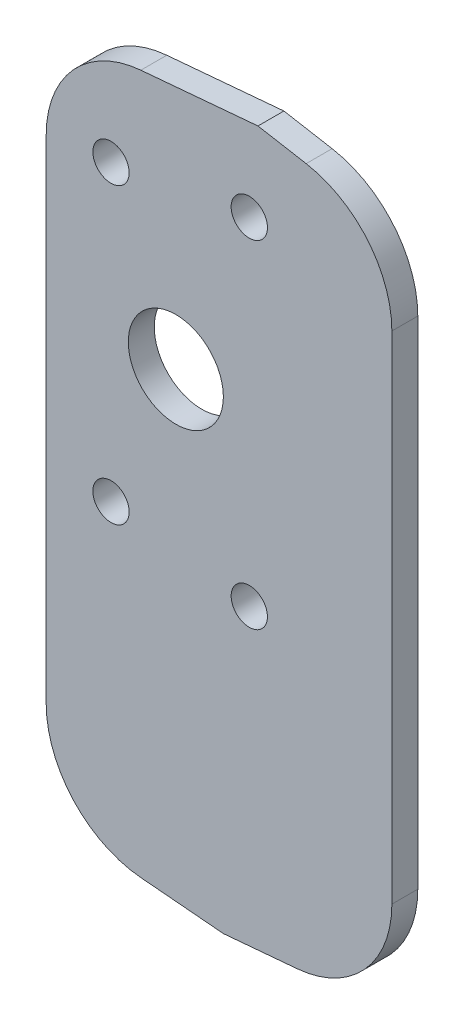
ISO-10303-21;
HEADER;
FILE_DESCRIPTION(('STEP AP214'),'2;1');
FILE_NAME('part.step','',(''),(''),'','','');
FILE_SCHEMA(('AUTOMOTIVE_DESIGN { 1 0 10303 214 1 1 1 1 }'));
ENDSEC;
DATA;
#1=APPLICATION_CONTEXT('core data for automotive mechanical design processes');
#2=APPLICATION_PROTOCOL_DEFINITION('international standard','automotive_design',2000,#1);
#3=PRODUCT_CONTEXT('',#1,'mechanical');
#4=PRODUCT('Part','Part','',(#3));
#5=PRODUCT_RELATED_PRODUCT_CATEGORY('part','',(#4));
#6=PRODUCT_DEFINITION_FORMATION('','',#4);
#7=PRODUCT_DEFINITION_CONTEXT('part definition',#1,'design');
#8=PRODUCT_DEFINITION('design','',#6,#7);
#9=PRODUCT_DEFINITION_SHAPE('','',#8);
#10=(LENGTH_UNIT() NAMED_UNIT(*) SI_UNIT(.MILLI.,.METRE.));
#11=(NAMED_UNIT(*) PLANE_ANGLE_UNIT() SI_UNIT($,.RADIAN.));
#12=(NAMED_UNIT(*) SI_UNIT($,.STERADIAN.) SOLID_ANGLE_UNIT());
#13=UNCERTAINTY_MEASURE_WITH_UNIT(LENGTH_MEASURE(1.E-05),#10,'distance_accuracy_value','');
#14=(GEOMETRIC_REPRESENTATION_CONTEXT(3) GLOBAL_UNCERTAINTY_ASSIGNED_CONTEXT((#13)) GLOBAL_UNIT_ASSIGNED_CONTEXT((#10,
#11,#12)) REPRESENTATION_CONTEXT('',''));
#15=CARTESIAN_POINT('',(0.,0.,0.));
#16=DIRECTION('',(0.,0.,1.));
#17=DIRECTION('',(1.,0.,0.));
#18=AXIS2_PLACEMENT_3D('',#15,#16,#17);
#19=CARTESIAN_POINT('',(-5.95987876232495,-14.4724405128534,3.));
#20=DIRECTION('',(1.,0.,0.));
#21=DIRECTION('',(0.,1.,0.));
#22=AXIS2_PLACEMENT_3D('',#19,#20,#21);
#23=PLANE('',#22);
#24=DIRECTION('',(0.,-1.,0.));
#25=VECTOR('',#24,1.);
#26=CARTESIAN_POINT('',(-5.95987876232495,-14.4724405128534,0.));
#27=LINE('',#26,#25);
#28=CARTESIAN_POINT('',(-5.959878762325,53.5315853989375,0.));
#29=VERTEX_POINT('',#28);
#30=CARTESIAN_POINT('',(-5.95987876232496,-3.47646642464427,0.));
#31=VERTEX_POINT('',#30);
#32=EDGE_CURVE('E124',#29,#31,#27,.T.);
#33=ORIENTED_EDGE('',*,*,#32,.T.);
#34=DIRECTION('',(0.,0.,-1.));
#35=VECTOR('',#34,1.);
#36=CARTESIAN_POINT('',(-5.95987876232496,-3.47646642464427,3.));
#37=LINE('',#36,#35);
#38=CARTESIAN_POINT('',(-5.95987876232496,-3.47646642464427,3.));
#39=VERTEX_POINT('',#38);
#40=EDGE_CURVE('E172',#31,#39,#37,.F.);
#41=ORIENTED_EDGE('',*,*,#40,.T.);
#42=DIRECTION('',(0.,-1.,0.));
#43=VECTOR('',#42,1.);
#44=CARTESIAN_POINT('',(-5.95987876232495,-14.4724405128534,3.));
#45=LINE('',#44,#43);
#46=CARTESIAN_POINT('',(-5.959878762325,53.5315853989375,3.));
#47=VERTEX_POINT('',#46);
#48=EDGE_CURVE('E147',#47,#39,#45,.T.);
#49=ORIENTED_EDGE('',*,*,#48,.F.);
#50=DIRECTION('',(0.,0.,-1.));
#51=VECTOR('',#50,1.);
#52=CARTESIAN_POINT('',(-5.959878762325,53.5315853989375,3.));
#53=LINE('',#52,#51);
#54=EDGE_CURVE('E169',#47,#29,#53,.T.);
#55=ORIENTED_EDGE('',*,*,#54,.T.);
#56=EDGE_LOOP('',(#33,#41,#49,#55));
#57=FACE_BOUND('',#56,.T.);
#58=ADVANCED_FACE('F35',(#57),#23,.F.);
#59=CARTESIAN_POINT('',(14.54492368714,-16.2663782750201,3.));
#60=DIRECTION('',(0.0871557427476542,0.996194698091746,0.));
#61=DIRECTION('',(-0.996194698091746,0.0871557427476543,0.));
#62=AXIS2_PLACEMENT_3D('',#59,#60,#61);
#63=PLANE('',#62);
#64=DIRECTION('',(0.996194698091746,-0.0871557427476543,0.));
#65=VECTOR('',#64,1.);
#66=CARTESIAN_POINT('',(14.54492368714,-16.2663782750201,3.));
#67=LINE('',#66,#65);
#68=CARTESIAN_POINT('',(4.99425232470319,-15.4308028017452,3.));
#69=VERTEX_POINT('',#68);
#70=CARTESIAN_POINT('',(14.54492368714,-16.2663782750201,3.));
#71=VERTEX_POINT('',#70);
#72=EDGE_CURVE('E150',#69,#71,#67,.T.);
#73=ORIENTED_EDGE('',*,*,#72,.F.);
#74=DIRECTION('',(0.,0.,-1.));
#75=VECTOR('',#74,1.);
#76=CARTESIAN_POINT('',(4.99425232470319,-15.4308028017452,3.));
#77=LINE('',#76,#75);
#78=CARTESIAN_POINT('',(4.99425232470319,-15.4308028017452,0.));
#79=VERTEX_POINT('',#78);
#80=EDGE_CURVE('E120',#69,#79,#77,.T.);
#81=ORIENTED_EDGE('',*,*,#80,.T.);
#82=DIRECTION('',(0.996194698091746,-0.0871557427476543,0.));
#83=VECTOR('',#82,1.);
#84=CARTESIAN_POINT('',(14.54492368714,-16.2663782750201,0.));
#85=LINE('',#84,#83);
#86=CARTESIAN_POINT('',(14.54492368714,-16.2663782750201,0.));
#87=VERTEX_POINT('',#86);
#88=EDGE_CURVE('E113',#79,#87,#85,.T.);
#89=ORIENTED_EDGE('',*,*,#88,.T.);
#90=DIRECTION('',(0.,0.,-1.));
#91=VECTOR('',#90,1.);
#92=CARTESIAN_POINT('',(14.54492368714,-16.2663782750201,3.));
#93=LINE('',#92,#91);
#94=EDGE_CURVE('E117',#71,#87,#93,.T.);
#95=ORIENTED_EDGE('',*,*,#94,.F.);
#96=EDGE_LOOP('',(#73,#81,#89,#95));
#97=FACE_BOUND('',#96,.T.);
#98=ADVANCED_FACE('F116',(#97),#63,.F.);
#99=CARTESIAN_POINT('',(34.0401212376751,-14.56076949615,3.));
#100=DIRECTION('',(-0.0871557427476554,0.996194698091746,0.));
#101=DIRECTION('',(-0.996194698091746,-0.0871557427476555,0.));
#102=AXIS2_PLACEMENT_3D('',#99,#100,#101);
#103=PLANE('',#102);
#104=DIRECTION('',(0.996194698091746,0.0871557427476554,0.));
#105=VECTOR('',#104,1.);
#106=CARTESIAN_POINT('',(34.0401212376751,-14.56076949615,0.));
#107=LINE('',#106,#105);
#108=CARTESIAN_POINT('',(23.0859901506469,-15.5191317850418,0.));
#109=VERTEX_POINT('',#108);
#110=EDGE_CURVE('E123',#87,#109,#107,.T.);
#111=ORIENTED_EDGE('',*,*,#110,.T.);
#112=DIRECTION('',(0.,0.,-1.));
#113=VECTOR('',#112,1.);
#114=CARTESIAN_POINT('',(23.0859901506469,-15.5191317850418,3.));
#115=LINE('',#114,#113);
#116=CARTESIAN_POINT('',(23.0859901506469,-15.5191317850418,3.));
#117=VERTEX_POINT('',#116);
#118=EDGE_CURVE('E186',#109,#117,#115,.F.);
#119=ORIENTED_EDGE('',*,*,#118,.T.);
#120=DIRECTION('',(0.996194698091746,0.0871557427476554,0.));
#121=VECTOR('',#120,1.);
#122=CARTESIAN_POINT('',(34.0401212376751,-14.56076949615,3.));
#123=LINE('',#122,#121);
#124=EDGE_CURVE('E131',#71,#117,#123,.T.);
#125=ORIENTED_EDGE('',*,*,#124,.F.);
#126=ORIENTED_EDGE('',*,*,#94,.T.);
#127=EDGE_LOOP('',(#111,#119,#125,#126));
#128=FACE_BOUND('',#127,.T.);
#129=ADVANCED_FACE('F128',(#128),#103,.F.);
#130=CARTESIAN_POINT('',(34.040121237675,63.93923050385,3.));
#131=DIRECTION('',(-1.,0.,0.));
#132=DIRECTION('',(0.,-1.,0.));
#133=AXIS2_PLACEMENT_3D('',#130,#131,#132);
#134=PLANE('',#133);
#135=DIRECTION('',(0.,1.,0.));
#136=VECTOR('',#135,1.);
#137=CARTESIAN_POINT('',(34.040121237675,63.93923050385,3.));
#138=LINE('',#137,#136);
#139=CARTESIAN_POINT('',(34.040121237675,-3.56479540794083,3.));
#140=VERTEX_POINT('',#139);
#141=CARTESIAN_POINT('',(34.040121237675,53.8700349297226,3.));
#142=VERTEX_POINT('',#141);
#143=EDGE_CURVE('E153',#140,#142,#138,.T.);
#144=ORIENTED_EDGE('',*,*,#143,.F.);
#145=DIRECTION('',(0.,0.,-1.));
#146=VECTOR('',#145,1.);
#147=CARTESIAN_POINT('',(34.040121237675,-3.56479540794083,3.));
#148=LINE('',#147,#146);
#149=CARTESIAN_POINT('',(34.040121237675,-3.56479540794083,0.));
#150=VERTEX_POINT('',#149);
#151=EDGE_CURVE('E183',#140,#150,#148,.T.);
#152=ORIENTED_EDGE('',*,*,#151,.T.);
#153=DIRECTION('',(0.,1.,0.));
#154=VECTOR('',#153,1.);
#155=CARTESIAN_POINT('',(34.040121237675,63.93923050385,0.));
#156=LINE('',#155,#154);
#157=CARTESIAN_POINT('',(34.040121237675,53.8700349297226,0.));
#158=VERTEX_POINT('',#157);
#159=EDGE_CURVE('E137',#150,#158,#156,.T.);
#160=ORIENTED_EDGE('',*,*,#159,.T.);
#161=DIRECTION('',(0.,0.,-1.));
#162=VECTOR('',#161,1.);
#163=CARTESIAN_POINT('',(34.040121237675,53.8700349297226,3.));
#164=LINE('',#163,#162);
#165=EDGE_CURVE('E181',#158,#142,#164,.F.);
#166=ORIENTED_EDGE('',*,*,#165,.T.);
#167=EDGE_LOOP('',(#144,#152,#160,#166));
#168=FACE_BOUND('',#167,.T.);
#169=ADVANCED_FACE('F215',(#168),#134,.F.);
#170=CARTESIAN_POINT('',(18.5449236871399,66.671451903417,3.));
#171=DIRECTION('',(-0.173648177666926,-0.984807753012209,0.));
#172=DIRECTION('',(0.984807753012209,-0.173648177666926,0.));
#173=AXIS2_PLACEMENT_3D('',#170,#171,#172);
#174=PLANE('',#173);
#175=DIRECTION('',(-0.984807753012209,0.173648177666926,0.));
#176=VECTOR('',#175,1.);
#177=CARTESIAN_POINT('',(18.5449236871399,66.671451903417,3.));
#178=LINE('',#177,#176);
#179=CARTESIAN_POINT('',(24.1238993696781,65.6877279658691,3.));
#180=VERTEX_POINT('',#179);
#181=CARTESIAN_POINT('',(18.5449236871399,66.671451903417,3.));
#182=VERTEX_POINT('',#181);
#183=EDGE_CURVE('E155',#180,#182,#178,.T.);
#184=ORIENTED_EDGE('',*,*,#183,.F.);
#185=DIRECTION('',(0.,0.,-1.));
#186=VECTOR('',#185,1.);
#187=CARTESIAN_POINT('',(24.1238993696781,65.6877279658691,3.));
#188=LINE('',#187,#186);
#189=CARTESIAN_POINT('',(24.1238993696781,65.6877279658691,0.));
#190=VERTEX_POINT('',#189);
#191=EDGE_CURVE('E42',#180,#190,#188,.T.);
#192=ORIENTED_EDGE('',*,*,#191,.T.);
#193=DIRECTION('',(-0.984807753012209,0.173648177666926,0.));
#194=VECTOR('',#193,1.);
#195=CARTESIAN_POINT('',(18.5449236871399,66.671451903417,0.));
#196=LINE('',#195,#194);
#197=CARTESIAN_POINT('',(18.5449236871399,66.671451903417,0.));
#198=VERTEX_POINT('',#197);
#199=EDGE_CURVE('E140',#190,#198,#196,.T.);
#200=ORIENTED_EDGE('',*,*,#199,.T.);
#201=DIRECTION('',(0.,0.,-1.));
#202=VECTOR('',#201,1.);
#203=CARTESIAN_POINT('',(18.5449236871399,66.671451903417,3.));
#204=LINE('',#203,#202);
#205=EDGE_CURVE('E132',#182,#198,#204,.T.);
#206=ORIENTED_EDGE('',*,*,#205,.F.);
#207=EDGE_LOOP('',(#184,#192,#200,#206));
#208=FACE_BOUND('',#207,.T.);
#209=ADVANCED_FACE('F191',(#208),#174,.F.);
#210=CARTESIAN_POINT('',(-5.959878762325,64.5275594871466,3.));
#211=DIRECTION('',(0.0871557427476557,-0.996194698091746,0.));
#212=DIRECTION('',(0.996194698091746,0.0871557427476557,0.));
#213=AXIS2_PLACEMENT_3D('',#210,#211,#212);
#214=PLANE('',#213);
#215=DIRECTION('',(-0.996194698091746,-0.0871557427476557,0.));
#216=VECTOR('',#215,1.);
#217=CARTESIAN_POINT('',(-5.959878762325,64.5275594871466,0.));
#218=LINE('',#217,#216);
#219=CARTESIAN_POINT('',(4.99425232470313,65.4859217760385,0.));
#220=VERTEX_POINT('',#219);
#221=EDGE_CURVE('E145',#198,#220,#218,.T.);
#222=ORIENTED_EDGE('',*,*,#221,.T.);
#223=DIRECTION('',(0.,0.,-1.));
#224=VECTOR('',#223,1.);
#225=CARTESIAN_POINT('',(4.99425232470314,65.4859217760385,3.));
#226=LINE('',#225,#224);
#227=CARTESIAN_POINT('',(4.99425232470313,65.4859217760385,3.));
#228=VERTEX_POINT('',#227);
#229=EDGE_CURVE('E11',#220,#228,#226,.F.);
#230=ORIENTED_EDGE('',*,*,#229,.T.);
#231=DIRECTION('',(-0.996194698091746,-0.0871557427476557,0.));
#232=VECTOR('',#231,1.);
#233=CARTESIAN_POINT('',(-5.959878762325,64.5275594871466,3.));
#234=LINE('',#233,#232);
#235=EDGE_CURVE('E157',#182,#228,#234,.T.);
#236=ORIENTED_EDGE('',*,*,#235,.F.);
#237=ORIENTED_EDGE('',*,*,#205,.T.);
#238=EDGE_LOOP('',(#222,#230,#236,#237));
#239=FACE_BOUND('',#238,.T.);
#240=ADVANCED_FACE('F196',(#239),#214,.F.);
#241=CARTESIAN_POINT('',(-5.95987876232495,-18.0603160371868,3.));
#242=DIRECTION('',(0.,0.,1.));
#243=DIRECTION('',(1.,0.,0.));
#244=AXIS2_PLACEMENT_3D('',#241,#242,#243);
#245=PLANE('',#244);
#246=CARTESIAN_POINT('',(1.54012123767499,54.5275594871466,3.));
#247=DIRECTION('',(0.,0.,1.));
#248=DIRECTION('',(1.,0.,0.));
#249=AXIS2_PLACEMENT_3D('',#246,#247,#248);
#250=CIRCLE('',#249,2.09999999999999);
#251=CARTESIAN_POINT('',(3.64012123767498,54.5275594871466,3.));
#252=VERTEX_POINT('',#251);
#253=EDGE_CURVE('E343',#252,#252,#250,.T.);
#254=ORIENTED_EDGE('',*,*,#253,.F.);
#255=EDGE_LOOP('',(#254));
#256=FACE_BOUND('',#255,.T.);
#257=CARTESIAN_POINT('',(17.540121237675,57.0275594871466,3.));
#258=DIRECTION('',(0.,0.,1.));
#259=DIRECTION('',(1.,0.,0.));
#260=AXIS2_PLACEMENT_3D('',#257,#258,#259);
#261=CIRCLE('',#260,2.09999999999999);
#262=CARTESIAN_POINT('',(19.640121237675,57.0275594871466,3.));
#263=VERTEX_POINT('',#262);
#264=EDGE_CURVE('E347',#263,#263,#261,.T.);
#265=ORIENTED_EDGE('',*,*,#264,.F.);
#266=EDGE_LOOP('',(#265));
#267=FACE_BOUND('',#266,.T.);
#268=CARTESIAN_POINT('',(1.540121237675,20.5275594871466,3.));
#269=DIRECTION('',(0.,0.,1.));
#270=DIRECTION('',(1.,0.,0.));
#271=AXIS2_PLACEMENT_3D('',#268,#269,#270);
#272=CIRCLE('',#271,2.09999999999999);
#273=CARTESIAN_POINT('',(3.64012123767499,20.5275594871466,3.));
#274=VERTEX_POINT('',#273);
#275=EDGE_CURVE('E356',#274,#274,#272,.T.);
#276=ORIENTED_EDGE('',*,*,#275,.F.);
#277=EDGE_LOOP('',(#276));
#278=FACE_BOUND('',#277,.T.);
#279=CARTESIAN_POINT('',(17.540121237675,18.0275594871466,3.));
#280=DIRECTION('',(0.,0.,1.));
#281=DIRECTION('',(1.,0.,0.));
#282=AXIS2_PLACEMENT_3D('',#279,#280,#281);
#283=CIRCLE('',#282,2.09999999999999);
#284=CARTESIAN_POINT('',(19.640121237675,18.0275594871466,3.));
#285=VERTEX_POINT('',#284);
#286=EDGE_CURVE('E362',#285,#285,#283,.T.);
#287=ORIENTED_EDGE('',*,*,#286,.F.);
#288=EDGE_LOOP('',(#287));
#289=FACE_BOUND('',#288,.T.);
#290=CARTESIAN_POINT('',(9.040121237675,37.5275594871466,3.));
#291=DIRECTION('',(0.,0.,1.));
#292=DIRECTION('',(1.,0.,0.));
#293=AXIS2_PLACEMENT_3D('',#290,#291,#292);
#294=CIRCLE('',#293,5.5);
#295=CARTESIAN_POINT('',(14.540121237675,37.5275594871466,3.));
#296=VERTEX_POINT('',#295);
#297=EDGE_CURVE('E365',#296,#296,#294,.T.);
#298=ORIENTED_EDGE('',*,*,#297,.F.);
#299=EDGE_LOOP('',(#298));
#300=FACE_BOUND('',#299,.T.);
#301=ORIENTED_EDGE('',*,*,#48,.T.);
#302=CARTESIAN_POINT('',(6.04012123767504,-3.47646642464426,3.));
#303=DIRECTION('',(0.,0.,1.));
#304=DIRECTION('',(1.,0.,0.));
#305=AXIS2_PLACEMENT_3D('',#302,#303,#304);
#306=CIRCLE('',#305,12.);
#307=EDGE_CURVE('E179',#39,#69,#306,.T.);
#308=ORIENTED_EDGE('',*,*,#307,.T.);
#309=ORIENTED_EDGE('',*,*,#72,.T.);
#310=ORIENTED_EDGE('',*,*,#124,.T.);
#311=CARTESIAN_POINT('',(22.040121237675,-3.56479540794084,3.));
#312=DIRECTION('',(0.,0.,1.));
#313=DIRECTION('',(1.,0.,0.));
#314=AXIS2_PLACEMENT_3D('',#311,#312,#313);
#315=CIRCLE('',#314,12.);
#316=EDGE_CURVE('E177',#117,#140,#315,.T.);
#317=ORIENTED_EDGE('',*,*,#316,.T.);
#318=ORIENTED_EDGE('',*,*,#143,.T.);
#319=CARTESIAN_POINT('',(22.040121237675,53.8700349297226,3.));
#320=DIRECTION('',(0.,0.,1.));
#321=DIRECTION('',(1.,0.,0.));
#322=AXIS2_PLACEMENT_3D('',#319,#320,#321);
#323=CIRCLE('',#322,12.);
#324=EDGE_CURVE('E55',#142,#180,#323,.T.);
#325=ORIENTED_EDGE('',*,*,#324,.T.);
#326=ORIENTED_EDGE('',*,*,#183,.T.);
#327=ORIENTED_EDGE('',*,*,#235,.T.);
#328=CARTESIAN_POINT('',(6.040121237675,53.5315853989375,3.));
#329=DIRECTION('',(0.,0.,1.));
#330=DIRECTION('',(1.,0.,0.));
#331=AXIS2_PLACEMENT_3D('',#328,#329,#330);
#332=CIRCLE('',#331,12.);
#333=EDGE_CURVE('E174',#228,#47,#332,.T.);
#334=ORIENTED_EDGE('',*,*,#333,.T.);
#335=EDGE_LOOP('',(#301,#308,#309,#310,#317,#318,#325,#326,#327,#334));
#336=FACE_BOUND('',#335,.T.);
#337=ADVANCED_FACE('F202',(#256,#267,#278,#289,#300,#336),#245,.T.);
#338=CARTESIAN_POINT('',(-5.95987876232495,-18.0603160371868,0.));
#339=DIRECTION('',(0.,0.,1.));
#340=DIRECTION('',(1.,0.,0.));
#341=AXIS2_PLACEMENT_3D('',#338,#339,#340);
#342=PLANE('',#341);
#343=CARTESIAN_POINT('',(1.54012123767499,54.5275594871466,0.));
#344=DIRECTION('',(0.,0.,1.));
#345=DIRECTION('',(1.,0.,0.));
#346=AXIS2_PLACEMENT_3D('',#343,#344,#345);
#347=CIRCLE('',#346,2.09999999999999);
#348=CARTESIAN_POINT('',(3.64012123767498,54.5275594871466,0.));
#349=VERTEX_POINT('',#348);
#350=EDGE_CURVE('E340',#349,#349,#347,.T.);
#351=ORIENTED_EDGE('',*,*,#350,.T.);
#352=EDGE_LOOP('',(#351));
#353=FACE_BOUND('',#352,.T.);
#354=CARTESIAN_POINT('',(17.540121237675,57.0275594871466,0.));
#355=DIRECTION('',(0.,0.,1.));
#356=DIRECTION('',(1.,0.,0.));
#357=AXIS2_PLACEMENT_3D('',#354,#355,#356);
#358=CIRCLE('',#357,2.09999999999999);
#359=CARTESIAN_POINT('',(19.640121237675,57.0275594871466,0.));
#360=VERTEX_POINT('',#359);
#361=EDGE_CURVE('E344',#360,#360,#358,.T.);
#362=ORIENTED_EDGE('',*,*,#361,.T.);
#363=EDGE_LOOP('',(#362));
#364=FACE_BOUND('',#363,.T.);
#365=CARTESIAN_POINT('',(1.540121237675,20.5275594871466,0.));
#366=DIRECTION('',(0.,0.,1.));
#367=DIRECTION('',(1.,0.,0.));
#368=AXIS2_PLACEMENT_3D('',#365,#366,#367);
#369=CIRCLE('',#368,2.09999999999999);
#370=CARTESIAN_POINT('',(3.64012123767499,20.5275594871466,0.));
#371=VERTEX_POINT('',#370);
#372=EDGE_CURVE('E353',#371,#371,#369,.T.);
#373=ORIENTED_EDGE('',*,*,#372,.T.);
#374=EDGE_LOOP('',(#373));
#375=FACE_BOUND('',#374,.T.);
#376=CARTESIAN_POINT('',(17.540121237675,18.0275594871466,0.));
#377=DIRECTION('',(0.,0.,1.));
#378=DIRECTION('',(1.,0.,0.));
#379=AXIS2_PLACEMENT_3D('',#376,#377,#378);
#380=CIRCLE('',#379,2.09999999999999);
#381=CARTESIAN_POINT('',(19.640121237675,18.0275594871466,0.));
#382=VERTEX_POINT('',#381);
#383=EDGE_CURVE('E359',#382,#382,#380,.T.);
#384=ORIENTED_EDGE('',*,*,#383,.T.);
#385=EDGE_LOOP('',(#384));
#386=FACE_BOUND('',#385,.T.);
#387=CARTESIAN_POINT('',(9.040121237675,37.5275594871466,0.));
#388=DIRECTION('',(0.,0.,1.));
#389=DIRECTION('',(1.,0.,0.));
#390=AXIS2_PLACEMENT_3D('',#387,#388,#389);
#391=CIRCLE('',#390,5.5);
#392=CARTESIAN_POINT('',(14.540121237675,37.5275594871466,0.));
#393=VERTEX_POINT('',#392);
#394=EDGE_CURVE('E368',#393,#393,#391,.T.);
#395=ORIENTED_EDGE('',*,*,#394,.T.);
#396=EDGE_LOOP('',(#395));
#397=FACE_BOUND('',#396,.T.);
#398=ORIENTED_EDGE('',*,*,#88,.F.);
#399=CARTESIAN_POINT('',(6.04012123767504,-3.47646642464426,0.));
#400=DIRECTION('',(0.,0.,1.));
#401=DIRECTION('',(1.,0.,0.));
#402=AXIS2_PLACEMENT_3D('',#399,#400,#401);
#403=CIRCLE('',#402,12.);
#404=EDGE_CURVE('E167',#79,#31,#403,.F.);
#405=ORIENTED_EDGE('',*,*,#404,.T.);
#406=ORIENTED_EDGE('',*,*,#32,.F.);
#407=CARTESIAN_POINT('',(6.040121237675,53.5315853989375,0.));
#408=DIRECTION('',(0.,0.,1.));
#409=DIRECTION('',(1.,0.,0.));
#410=AXIS2_PLACEMENT_3D('',#407,#408,#409);
#411=CIRCLE('',#410,12.);
#412=EDGE_CURVE('E162',#29,#220,#411,.F.);
#413=ORIENTED_EDGE('',*,*,#412,.T.);
#414=ORIENTED_EDGE('',*,*,#221,.F.);
#415=ORIENTED_EDGE('',*,*,#199,.F.);
#416=CARTESIAN_POINT('',(22.040121237675,53.8700349297226,0.));
#417=DIRECTION('',(0.,0.,1.));
#418=DIRECTION('',(1.,0.,0.));
#419=AXIS2_PLACEMENT_3D('',#416,#417,#418);
#420=CIRCLE('',#419,12.);
#421=EDGE_CURVE('E164',#190,#158,#420,.F.);
#422=ORIENTED_EDGE('',*,*,#421,.T.);
#423=ORIENTED_EDGE('',*,*,#159,.F.);
#424=CARTESIAN_POINT('',(22.040121237675,-3.56479540794084,0.));
#425=DIRECTION('',(0.,0.,1.));
#426=DIRECTION('',(1.,0.,0.));
#427=AXIS2_PLACEMENT_3D('',#424,#425,#426);
#428=CIRCLE('',#427,12.);
#429=EDGE_CURVE('E136',#150,#109,#428,.F.);
#430=ORIENTED_EDGE('',*,*,#429,.T.);
#431=ORIENTED_EDGE('',*,*,#110,.F.);
#432=EDGE_LOOP('',(#398,#405,#406,#413,#414,#415,#422,#423,#430,#431));
#433=FACE_BOUND('',#432,.T.);
#434=ADVANCED_FACE('F134',(#353,#364,#375,#386,#397,#433),#342,.F.);
#435=CARTESIAN_POINT('',(9.040121237675,37.5275594871466,0.));
#436=DIRECTION('',(0.,0.,1.));
#437=DIRECTION('',(1.,0.,0.));
#438=AXIS2_PLACEMENT_3D('',#435,#436,#437);
#439=CYLINDRICAL_SURFACE('',#438,5.5);
#440=ORIENTED_EDGE('',*,*,#394,.F.);
#441=EDGE_LOOP('',(#440));
#442=FACE_BOUND('',#441,.T.);
#443=ORIENTED_EDGE('',*,*,#297,.T.);
#444=EDGE_LOOP('',(#443));
#445=FACE_BOUND('',#444,.T.);
#446=ADVANCED_FACE('F247',(#442,#445),#439,.F.);
#447=CARTESIAN_POINT('',(6.04012123767504,-3.47646642464426,3.));
#448=DIRECTION('',(0.,0.,-1.));
#449=DIRECTION('',(-1.,0.,0.));
#450=AXIS2_PLACEMENT_3D('',#447,#448,#449);
#451=CYLINDRICAL_SURFACE('',#450,12.);
#452=ORIENTED_EDGE('',*,*,#307,.F.);
#453=ORIENTED_EDGE('',*,*,#40,.F.);
#454=ORIENTED_EDGE('',*,*,#404,.F.);
#455=ORIENTED_EDGE('',*,*,#80,.F.);
#456=EDGE_LOOP('',(#452,#453,#454,#455));
#457=FACE_BOUND('',#456,.T.);
#458=ADVANCED_FACE('F208',(#457),#451,.T.);
#459=CARTESIAN_POINT('',(22.040121237675,-3.56479540794084,3.));
#460=DIRECTION('',(0.,0.,-1.));
#461=DIRECTION('',(-1.,0.,0.));
#462=AXIS2_PLACEMENT_3D('',#459,#460,#461);
#463=CYLINDRICAL_SURFACE('',#462,12.);
#464=ORIENTED_EDGE('',*,*,#316,.F.);
#465=ORIENTED_EDGE('',*,*,#118,.F.);
#466=ORIENTED_EDGE('',*,*,#429,.F.);
#467=ORIENTED_EDGE('',*,*,#151,.F.);
#468=EDGE_LOOP('',(#464,#465,#466,#467));
#469=FACE_BOUND('',#468,.T.);
#470=ADVANCED_FACE('F213',(#469),#463,.T.);
#471=CARTESIAN_POINT('',(22.040121237675,53.8700349297226,3.));
#472=DIRECTION('',(0.,0.,-1.));
#473=DIRECTION('',(-1.,0.,0.));
#474=AXIS2_PLACEMENT_3D('',#471,#472,#473);
#475=CYLINDRICAL_SURFACE('',#474,12.);
#476=ORIENTED_EDGE('',*,*,#324,.F.);
#477=ORIENTED_EDGE('',*,*,#165,.F.);
#478=ORIENTED_EDGE('',*,*,#421,.F.);
#479=ORIENTED_EDGE('',*,*,#191,.F.);
#480=EDGE_LOOP('',(#476,#477,#478,#479));
#481=FACE_BOUND('',#480,.T.);
#482=ADVANCED_FACE('F217',(#481),#475,.T.);
#483=CARTESIAN_POINT('',(6.040121237675,53.5315853989375,3.));
#484=DIRECTION('',(0.,0.,-1.));
#485=DIRECTION('',(-1.,0.,0.));
#486=AXIS2_PLACEMENT_3D('',#483,#484,#485);
#487=CYLINDRICAL_SURFACE('',#486,12.);
#488=ORIENTED_EDGE('',*,*,#333,.F.);
#489=ORIENTED_EDGE('',*,*,#229,.F.);
#490=ORIENTED_EDGE('',*,*,#412,.F.);
#491=ORIENTED_EDGE('',*,*,#54,.F.);
#492=EDGE_LOOP('',(#488,#489,#490,#491));
#493=FACE_BOUND('',#492,.T.);
#494=ADVANCED_FACE('F199',(#493),#487,.T.);
#495=CARTESIAN_POINT('',(17.540121237675,18.0275594871466,3.));
#496=DIRECTION('',(0.,0.,1.));
#497=DIRECTION('',(1.,0.,0.));
#498=AXIS2_PLACEMENT_3D('',#495,#496,#497);
#499=CYLINDRICAL_SURFACE('',#498,2.09999999999999);
#500=ORIENTED_EDGE('',*,*,#383,.F.);
#501=EDGE_LOOP('',(#500));
#502=FACE_BOUND('',#501,.T.);
#503=ORIENTED_EDGE('',*,*,#286,.T.);
#504=EDGE_LOOP('',(#503));
#505=FACE_BOUND('',#504,.T.);
#506=ADVANCED_FACE('F224',(#502,#505),#499,.F.);
#507=CARTESIAN_POINT('',(1.540121237675,20.5275594871466,3.));
#508=DIRECTION('',(0.,0.,1.));
#509=DIRECTION('',(1.,0.,0.));
#510=AXIS2_PLACEMENT_3D('',#507,#508,#509);
#511=CYLINDRICAL_SURFACE('',#510,2.09999999999999);
#512=ORIENTED_EDGE('',*,*,#372,.F.);
#513=EDGE_LOOP('',(#512));
#514=FACE_BOUND('',#513,.T.);
#515=ORIENTED_EDGE('',*,*,#275,.T.);
#516=EDGE_LOOP('',(#515));
#517=FACE_BOUND('',#516,.T.);
#518=ADVANCED_FACE('F296',(#514,#517),#511,.F.);
#519=CARTESIAN_POINT('',(17.540121237675,57.0275594871466,3.));
#520=DIRECTION('',(0.,0.,1.));
#521=DIRECTION('',(1.,0.,0.));
#522=AXIS2_PLACEMENT_3D('',#519,#520,#521);
#523=CYLINDRICAL_SURFACE('',#522,2.09999999999999);
#524=ORIENTED_EDGE('',*,*,#361,.F.);
#525=EDGE_LOOP('',(#524));
#526=FACE_BOUND('',#525,.T.);
#527=ORIENTED_EDGE('',*,*,#264,.T.);
#528=EDGE_LOOP('',(#527));
#529=FACE_BOUND('',#528,.T.);
#530=ADVANCED_FACE('F307',(#526,#529),#523,.F.);
#531=CARTESIAN_POINT('',(1.54012123767499,54.5275594871466,3.));
#532=DIRECTION('',(0.,0.,1.));
#533=DIRECTION('',(1.,0.,0.));
#534=AXIS2_PLACEMENT_3D('',#531,#532,#533);
#535=CYLINDRICAL_SURFACE('',#534,2.09999999999999);
#536=ORIENTED_EDGE('',*,*,#350,.F.);
#537=EDGE_LOOP('',(#536));
#538=FACE_BOUND('',#537,.T.);
#539=ORIENTED_EDGE('',*,*,#253,.T.);
#540=EDGE_LOOP('',(#539));
#541=FACE_BOUND('',#540,.T.);
#542=ADVANCED_FACE('F318',(#538,#541),#535,.F.);
#543=CLOSED_SHELL('',(#58,#98,#129,#169,#209,#240,#337,#434,#446,#458,#470,#482,#494,#506,#518,
#530,#542));
#544=MANIFOLD_SOLID_BREP('B2',#543);
#545=ADVANCED_BREP_SHAPE_REPRESENTATION('',(#18,#544),#14);
#546=SHAPE_DEFINITION_REPRESENTATION(#9,#545);
ENDSEC;
END-ISO-10303-21;
